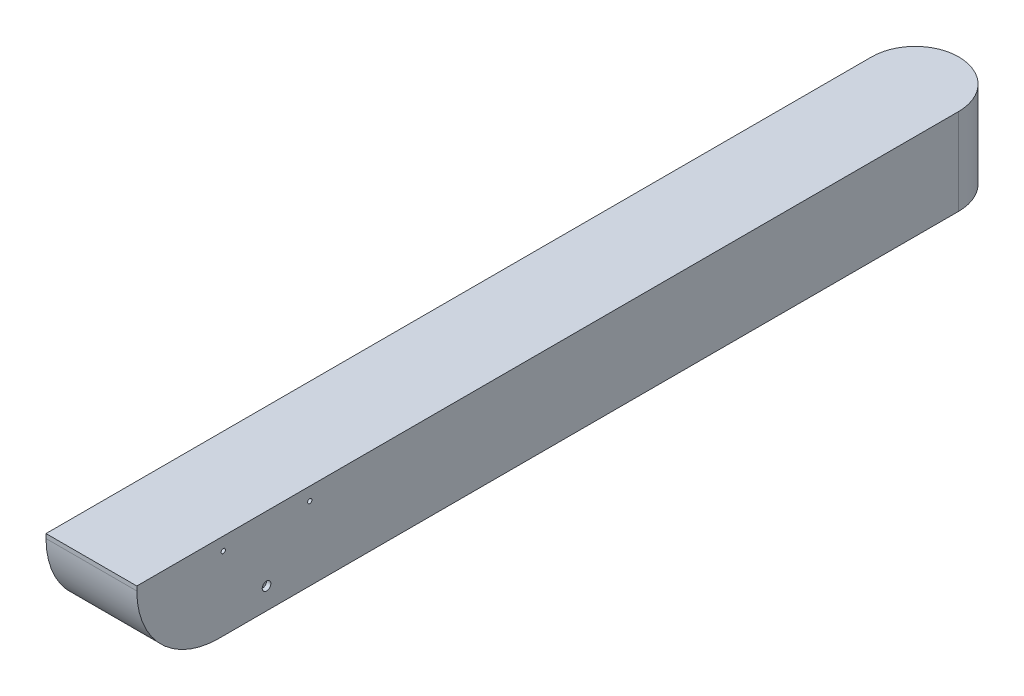
ISO-10303-21;
HEADER;
FILE_DESCRIPTION(('STEP AP214'),'2;1');
FILE_NAME('part.step','',(''),(''),'','','');
FILE_SCHEMA(('AUTOMOTIVE_DESIGN { 1 0 10303 214 1 1 1 1 }'));
ENDSEC;
DATA;
#1=APPLICATION_CONTEXT('core data for automotive mechanical design processes');
#2=APPLICATION_PROTOCOL_DEFINITION('international standard','automotive_design',2000,#1);
#3=PRODUCT_CONTEXT('',#1,'mechanical');
#4=PRODUCT('Part','Part','',(#3));
#5=PRODUCT_RELATED_PRODUCT_CATEGORY('part','',(#4));
#6=PRODUCT_DEFINITION_FORMATION('','',#4);
#7=PRODUCT_DEFINITION_CONTEXT('part definition',#1,'design');
#8=PRODUCT_DEFINITION('design','',#6,#7);
#9=PRODUCT_DEFINITION_SHAPE('','',#8);
#10=(LENGTH_UNIT() NAMED_UNIT(*) SI_UNIT(.MILLI.,.METRE.));
#11=(NAMED_UNIT(*) PLANE_ANGLE_UNIT() SI_UNIT($,.RADIAN.));
#12=(NAMED_UNIT(*) SI_UNIT($,.STERADIAN.) SOLID_ANGLE_UNIT());
#13=UNCERTAINTY_MEASURE_WITH_UNIT(LENGTH_MEASURE(1.E-05),#10,'distance_accuracy_value','');
#14=(GEOMETRIC_REPRESENTATION_CONTEXT(3) GLOBAL_UNCERTAINTY_ASSIGNED_CONTEXT((#13)) GLOBAL_UNIT_ASSIGNED_CONTEXT((#10,
#11,#12)) REPRESENTATION_CONTEXT('',''));
#15=CARTESIAN_POINT('',(0.,0.,0.));
#16=DIRECTION('',(0.,0.,1.));
#17=DIRECTION('',(1.,0.,0.));
#18=AXIS2_PLACEMENT_3D('',#15,#16,#17);
#19=CARTESIAN_POINT('',(100.,200.,100.));
#20=DIRECTION('',(0.,-1.,0.));
#21=DIRECTION('',(0.,0.,-1.));
#22=AXIS2_PLACEMENT_3D('',#19,#20,#21);
#23=CYLINDRICAL_SURFACE('',#22,100.);
#24=DIRECTION('',(0.,-1.,0.));
#25=VECTOR('',#24,1.);
#26=CARTESIAN_POINT('',(0.,200.,100.));
#27=LINE('',#26,#25);
#28=CARTESIAN_POINT('',(0.,200.,100.));
#29=VERTEX_POINT('',#28);
#30=CARTESIAN_POINT('',(0.,0.,100.));
#31=VERTEX_POINT('',#30);
#32=EDGE_CURVE('E127',#29,#31,#27,.T.);
#33=ORIENTED_EDGE('',*,*,#32,.F.);
#34=CARTESIAN_POINT('',(100.,200.,100.));
#35=DIRECTION('',(0.,1.,0.));
#36=DIRECTION('',(0.,0.,1.));
#37=AXIS2_PLACEMENT_3D('',#34,#35,#36);
#38=CIRCLE('',#37,100.);
#39=CARTESIAN_POINT('',(100.,200.,0.));
#40=VERTEX_POINT('',#39);
#41=EDGE_CURVE('E130',#40,#29,#38,.T.);
#42=ORIENTED_EDGE('',*,*,#41,.F.);
#43=DIRECTION('',(0.,1.,0.));
#44=VECTOR('',#43,1.);
#45=CARTESIAN_POINT('',(100.,200.,0.));
#46=LINE('',#45,#44);
#47=CARTESIAN_POINT('',(100.,0.,0.));
#48=VERTEX_POINT('',#47);
#49=EDGE_CURVE('E115',#40,#48,#46,.F.);
#50=ORIENTED_EDGE('',*,*,#49,.T.);
#51=CARTESIAN_POINT('',(100.,0.,100.));
#52=DIRECTION('',(0.,1.,0.));
#53=DIRECTION('',(0.,0.,1.));
#54=AXIS2_PLACEMENT_3D('',#51,#52,#53);
#55=CIRCLE('',#54,100.);
#56=EDGE_CURVE('E132',#31,#48,#55,.F.);
#57=ORIENTED_EDGE('',*,*,#56,.F.);
#58=EDGE_LOOP('',(#33,#42,#50,#57));
#59=FACE_BOUND('',#58,.T.);
#60=ADVANCED_FACE('F38',(#59),#23,.T.);
#61=CARTESIAN_POINT('',(100.,200.,110.));
#62=DIRECTION('',(0.,1.,0.));
#63=DIRECTION('',(0.,0.,1.));
#64=AXIS2_PLACEMENT_3D('',#61,#62,#63);
#65=CYLINDRICAL_SURFACE('',#64,110.);
#66=DIRECTION('',(0.,1.,0.));
#67=VECTOR('',#66,1.);
#68=CARTESIAN_POINT('',(210.,200.,110.));
#69=LINE('',#68,#67);
#70=CARTESIAN_POINT('',(210.,0.,110.));
#71=VERTEX_POINT('',#70);
#72=CARTESIAN_POINT('',(210.,200.,110.));
#73=VERTEX_POINT('',#72);
#74=EDGE_CURVE('E95',#71,#73,#69,.T.);
#75=ORIENTED_EDGE('',*,*,#74,.F.);
#76=CARTESIAN_POINT('',(100.,0.,110.));
#77=DIRECTION('',(0.,1.,0.));
#78=DIRECTION('',(0.,0.,1.));
#79=AXIS2_PLACEMENT_3D('',#76,#77,#78);
#80=CIRCLE('',#79,110.);
#81=EDGE_CURVE('E122',#48,#71,#80,.F.);
#82=ORIENTED_EDGE('',*,*,#81,.F.);
#83=ORIENTED_EDGE('',*,*,#49,.F.);
#84=CARTESIAN_POINT('',(100.,200.,110.));
#85=DIRECTION('',(0.,1.,0.));
#86=DIRECTION('',(0.,0.,1.));
#87=AXIS2_PLACEMENT_3D('',#84,#85,#86);
#88=CIRCLE('',#87,110.);
#89=EDGE_CURVE('E125',#73,#40,#88,.T.);
#90=ORIENTED_EDGE('',*,*,#89,.F.);
#91=EDGE_LOOP('',(#75,#82,#83,#90));
#92=FACE_BOUND('',#91,.T.);
#93=ADVANCED_FACE('F141',(#92),#65,.T.);
#94=CARTESIAN_POINT('',(0.,200.,2010.));
#95=DIRECTION('',(0.,0.,-1.));
#96=DIRECTION('',(-1.,0.,0.));
#97=AXIS2_PLACEMENT_3D('',#94,#95,#96);
#98=PLANE('',#97);
#99=DIRECTION('',(0.,-1.,0.));
#100=VECTOR('',#99,1.);
#101=CARTESIAN_POINT('',(0.,200.,2010.));
#102=LINE('',#101,#100);
#103=CARTESIAN_POINT('',(0.,200.,2010.));
#104=VERTEX_POINT('',#103);
#105=CARTESIAN_POINT('',(0.,190.,2010.));
#106=VERTEX_POINT('',#105);
#107=EDGE_CURVE('E113',#104,#106,#102,.T.);
#108=ORIENTED_EDGE('',*,*,#107,.T.);
#109=DIRECTION('',(1.,0.,0.));
#110=VECTOR('',#109,1.);
#111=CARTESIAN_POINT('',(0.,190.,2010.));
#112=LINE('',#111,#110);
#113=CARTESIAN_POINT('',(210.,190.,2010.));
#114=VERTEX_POINT('',#113);
#115=EDGE_CURVE('E112',#106,#114,#112,.T.);
#116=ORIENTED_EDGE('',*,*,#115,.T.);
#117=DIRECTION('',(0.,-1.,0.));
#118=VECTOR('',#117,1.);
#119=CARTESIAN_POINT('',(210.,200.,2010.));
#120=LINE('',#119,#118);
#121=CARTESIAN_POINT('',(210.,200.,2010.));
#122=VERTEX_POINT('',#121);
#123=EDGE_CURVE('E93',#122,#114,#120,.T.);
#124=ORIENTED_EDGE('',*,*,#123,.F.);
#125=DIRECTION('',(1.,0.,0.));
#126=VECTOR('',#125,1.);
#127=CARTESIAN_POINT('',(0.,200.,2010.));
#128=LINE('',#127,#126);
#129=EDGE_CURVE('E99',#104,#122,#128,.T.);
#130=ORIENTED_EDGE('',*,*,#129,.F.);
#131=EDGE_LOOP('',(#108,#116,#124,#130));
#132=FACE_BOUND('',#131,.T.);
#133=ADVANCED_FACE('F110',(#132),#98,.F.);
#134=CARTESIAN_POINT('',(210.,200.,2010.));
#135=DIRECTION('',(-1.,0.,0.));
#136=DIRECTION('',(0.,0.,1.));
#137=AXIS2_PLACEMENT_3D('',#134,#135,#136);
#138=PLANE('',#137);
#139=CARTESIAN_POINT('',(210.,170.,1610.));
#140=DIRECTION('',(1.,0.,0.));
#141=DIRECTION('',(0.,0.,-1.));
#142=AXIS2_PLACEMENT_3D('',#139,#140,#141);
#143=CIRCLE('',#142,4.99999999999982);
#144=CARTESIAN_POINT('',(210.,170.,1605.));
#145=VERTEX_POINT('',#144);
#146=EDGE_CURVE('E194',#145,#145,#143,.T.);
#147=ORIENTED_EDGE('',*,*,#146,.F.);
#148=EDGE_LOOP('',(#147));
#149=FACE_BOUND('',#148,.T.);
#150=CARTESIAN_POINT('',(210.,170.,1810.));
#151=DIRECTION('',(1.,0.,0.));
#152=DIRECTION('',(0.,0.,-1.));
#153=AXIS2_PLACEMENT_3D('',#150,#151,#152);
#154=CIRCLE('',#153,4.99999999999982);
#155=CARTESIAN_POINT('',(210.,170.,1805.));
#156=VERTEX_POINT('',#155);
#157=EDGE_CURVE('E195',#156,#156,#154,.T.);
#158=ORIENTED_EDGE('',*,*,#157,.F.);
#159=EDGE_LOOP('',(#158));
#160=FACE_BOUND('',#159,.T.);
#161=CARTESIAN_POINT('',(210.,50.,1710.));
#162=DIRECTION('',(1.,0.,0.));
#163=DIRECTION('',(0.,0.,-1.));
#164=AXIS2_PLACEMENT_3D('',#161,#162,#163);
#165=CIRCLE('',#164,10.0000000000001);
#166=CARTESIAN_POINT('',(210.,50.,1700.));
#167=VERTEX_POINT('',#166);
#168=EDGE_CURVE('E197',#167,#167,#165,.T.);
#169=ORIENTED_EDGE('',*,*,#168,.F.);
#170=EDGE_LOOP('',(#169));
#171=FACE_BOUND('',#170,.T.);
#172=ORIENTED_EDGE('',*,*,#123,.T.);
#173=CARTESIAN_POINT('',(210.,190.,1820.));
#174=DIRECTION('',(-1.,0.,0.));
#175=DIRECTION('',(0.,0.,1.));
#176=AXIS2_PLACEMENT_3D('',#173,#174,#175);
#177=CIRCLE('',#176,190.);
#178=CARTESIAN_POINT('',(210.,0.,1820.));
#179=VERTEX_POINT('',#178);
#180=EDGE_CURVE('E60',#114,#179,#177,.F.);
#181=ORIENTED_EDGE('',*,*,#180,.T.);
#182=DIRECTION('',(0.,0.,-1.));
#183=VECTOR('',#182,1.);
#184=CARTESIAN_POINT('',(210.,0.,2010.));
#185=LINE('',#184,#183);
#186=EDGE_CURVE('E146',#179,#71,#185,.T.);
#187=ORIENTED_EDGE('',*,*,#186,.T.);
#188=ORIENTED_EDGE('',*,*,#74,.T.);
#189=DIRECTION('',(0.,0.,-1.));
#190=VECTOR('',#189,1.);
#191=CARTESIAN_POINT('',(210.,200.,2010.));
#192=LINE('',#191,#190);
#193=EDGE_CURVE('E89',#122,#73,#192,.T.);
#194=ORIENTED_EDGE('',*,*,#193,.F.);
#195=EDGE_LOOP('',(#172,#181,#187,#188,#194));
#196=FACE_BOUND('',#195,.T.);
#197=ADVANCED_FACE('F91',(#149,#160,#171,#196),#138,.F.);
#198=CARTESIAN_POINT('',(0.,200.,0.));
#199=DIRECTION('',(1.,0.,0.));
#200=DIRECTION('',(0.,0.,-1.));
#201=AXIS2_PLACEMENT_3D('',#198,#199,#200);
#202=PLANE('',#201);
#203=CARTESIAN_POINT('',(0.,170.,1610.));
#204=DIRECTION('',(1.,0.,0.));
#205=DIRECTION('',(0.,0.,-1.));
#206=AXIS2_PLACEMENT_3D('',#203,#204,#205);
#207=CIRCLE('',#206,4.99999999999982);
#208=CARTESIAN_POINT('',(0.,170.,1605.));
#209=VERTEX_POINT('',#208);
#210=EDGE_CURVE('E191',#209,#209,#207,.T.);
#211=ORIENTED_EDGE('',*,*,#210,.T.);
#212=EDGE_LOOP('',(#211));
#213=FACE_BOUND('',#212,.T.);
#214=CARTESIAN_POINT('',(0.,170.,1810.));
#215=DIRECTION('',(1.,0.,0.));
#216=DIRECTION('',(0.,0.,-1.));
#217=AXIS2_PLACEMENT_3D('',#214,#215,#216);
#218=CIRCLE('',#217,4.99999999999982);
#219=CARTESIAN_POINT('',(0.,170.,1805.));
#220=VERTEX_POINT('',#219);
#221=EDGE_CURVE('E200',#220,#220,#218,.T.);
#222=ORIENTED_EDGE('',*,*,#221,.T.);
#223=EDGE_LOOP('',(#222));
#224=FACE_BOUND('',#223,.T.);
#225=DIRECTION('',(0.,0.,1.));
#226=VECTOR('',#225,1.);
#227=CARTESIAN_POINT('',(0.,0.,0.));
#228=LINE('',#227,#226);
#229=CARTESIAN_POINT('',(0.,0.,1820.));
#230=VERTEX_POINT('',#229);
#231=EDGE_CURVE('E107',#31,#230,#228,.T.);
#232=ORIENTED_EDGE('',*,*,#231,.T.);
#233=CARTESIAN_POINT('',(0.,190.,1820.));
#234=DIRECTION('',(1.,0.,0.));
#235=DIRECTION('',(0.,0.,-1.));
#236=AXIS2_PLACEMENT_3D('',#233,#234,#235);
#237=CIRCLE('',#236,190.);
#238=EDGE_CURVE('E11',#230,#106,#237,.F.);
#239=ORIENTED_EDGE('',*,*,#238,.T.);
#240=ORIENTED_EDGE('',*,*,#107,.F.);
#241=DIRECTION('',(0.,0.,1.));
#242=VECTOR('',#241,1.);
#243=CARTESIAN_POINT('',(0.,200.,0.));
#244=LINE('',#243,#242);
#245=EDGE_CURVE('E98',#29,#104,#244,.T.);
#246=ORIENTED_EDGE('',*,*,#245,.F.);
#247=ORIENTED_EDGE('',*,*,#32,.T.);
#248=EDGE_LOOP('',(#232,#239,#240,#246,#247));
#249=FACE_BOUND('',#248,.T.);
#250=ADVANCED_FACE('F143',(#213,#224,#249),#202,.F.);
#251=CARTESIAN_POINT('',(0.,200.,0.));
#252=DIRECTION('',(0.,1.,0.));
#253=DIRECTION('',(0.,0.,1.));
#254=AXIS2_PLACEMENT_3D('',#251,#252,#253);
#255=PLANE('',#254);
#256=ORIENTED_EDGE('',*,*,#89,.T.);
#257=ORIENTED_EDGE('',*,*,#41,.T.);
#258=ORIENTED_EDGE('',*,*,#245,.T.);
#259=ORIENTED_EDGE('',*,*,#129,.T.);
#260=ORIENTED_EDGE('',*,*,#193,.T.);
#261=EDGE_LOOP('',(#256,#257,#258,#259,#260));
#262=FACE_BOUND('',#261,.T.);
#263=ADVANCED_FACE('F102',(#262),#255,.T.);
#264=CARTESIAN_POINT('',(0.,0.,0.));
#265=DIRECTION('',(0.,1.,0.));
#266=DIRECTION('',(0.,0.,1.));
#267=AXIS2_PLACEMENT_3D('',#264,#265,#266);
#268=PLANE('',#267);
#269=ORIENTED_EDGE('',*,*,#186,.F.);
#270=DIRECTION('',(1.,0.,0.));
#271=VECTOR('',#270,1.);
#272=CARTESIAN_POINT('',(0.,0.,1820.));
#273=LINE('',#272,#271);
#274=EDGE_CURVE('E46',#179,#230,#273,.F.);
#275=ORIENTED_EDGE('',*,*,#274,.T.);
#276=ORIENTED_EDGE('',*,*,#231,.F.);
#277=ORIENTED_EDGE('',*,*,#56,.T.);
#278=ORIENTED_EDGE('',*,*,#81,.T.);
#279=EDGE_LOOP('',(#269,#275,#276,#277,#278));
#280=FACE_BOUND('',#279,.T.);
#281=ADVANCED_FACE('F136',(#280),#268,.F.);
#282=CARTESIAN_POINT('',(0.,190.,1820.));
#283=DIRECTION('',(1.,0.,0.));
#284=DIRECTION('',(0.,0.,-1.));
#285=AXIS2_PLACEMENT_3D('',#282,#283,#284);
#286=CYLINDRICAL_SURFACE('',#285,190.);
#287=ORIENTED_EDGE('',*,*,#238,.F.);
#288=ORIENTED_EDGE('',*,*,#274,.F.);
#289=ORIENTED_EDGE('',*,*,#180,.F.);
#290=ORIENTED_EDGE('',*,*,#115,.F.);
#291=EDGE_LOOP('',(#287,#288,#289,#290));
#292=FACE_BOUND('',#291,.T.);
#293=ADVANCED_FACE('F40',(#292),#286,.T.);
#294=CARTESIAN_POINT('',(200.,50.,1710.));
#295=DIRECTION('',(1.,0.,0.));
#296=DIRECTION('',(0.,0.,-1.));
#297=AXIS2_PLACEMENT_3D('',#294,#295,#296);
#298=CYLINDRICAL_SURFACE('',#297,10.0000000000001);
#299=CARTESIAN_POINT('',(200.,50.,1710.));
#300=DIRECTION('',(1.,0.,0.));
#301=DIRECTION('',(0.,0.,-1.));
#302=AXIS2_PLACEMENT_3D('',#299,#300,#301);
#303=CIRCLE('',#302,10.0000000000001);
#304=CARTESIAN_POINT('',(200.,50.,1700.));
#305=VERTEX_POINT('',#304);
#306=EDGE_CURVE('E147',#305,#305,#303,.T.);
#307=ORIENTED_EDGE('',*,*,#306,.F.);
#308=EDGE_LOOP('',(#307));
#309=FACE_BOUND('',#308,.T.);
#310=ORIENTED_EDGE('',*,*,#168,.T.);
#311=EDGE_LOOP('',(#310));
#312=FACE_BOUND('',#311,.T.);
#313=ADVANCED_FACE('F151',(#309,#312),#298,.F.);
#314=CARTESIAN_POINT('',(200.,50.,1710.));
#315=DIRECTION('',(1.,0.,0.));
#316=DIRECTION('',(0.,0.,-1.));
#317=AXIS2_PLACEMENT_3D('',#314,#315,#316);
#318=PLANE('',#317);
#319=ORIENTED_EDGE('',*,*,#306,.T.);
#320=EDGE_LOOP('',(#319));
#321=FACE_BOUND('',#320,.T.);
#322=ADVANCED_FACE('F156',(#321),#318,.T.);
#323=CARTESIAN_POINT('',(0.,170.,1810.));
#324=DIRECTION('',(1.,0.,0.));
#325=DIRECTION('',(0.,0.,-1.));
#326=AXIS2_PLACEMENT_3D('',#323,#324,#325);
#327=CYLINDRICAL_SURFACE('',#326,4.99999999999982);
#328=ORIENTED_EDGE('',*,*,#221,.F.);
#329=EDGE_LOOP('',(#328));
#330=FACE_BOUND('',#329,.T.);
#331=ORIENTED_EDGE('',*,*,#157,.T.);
#332=EDGE_LOOP('',(#331));
#333=FACE_BOUND('',#332,.T.);
#334=ADVANCED_FACE('F178',(#330,#333),#327,.F.);
#335=CARTESIAN_POINT('',(0.,170.,1610.));
#336=DIRECTION('',(1.,0.,0.));
#337=DIRECTION('',(0.,0.,-1.));
#338=AXIS2_PLACEMENT_3D('',#335,#336,#337);
#339=CYLINDRICAL_SURFACE('',#338,4.99999999999982);
#340=ORIENTED_EDGE('',*,*,#210,.F.);
#341=EDGE_LOOP('',(#340));
#342=FACE_BOUND('',#341,.T.);
#343=ORIENTED_EDGE('',*,*,#146,.T.);
#344=EDGE_LOOP('',(#343));
#345=FACE_BOUND('',#344,.T.);
#346=ADVANCED_FACE('F182',(#342,#345),#339,.F.);
#347=CLOSED_SHELL('',(#60,#93,#133,#197,#250,#263,#281,#293,#313,#322,#334,#346));
#348=MANIFOLD_SOLID_BREP('B2',#347);
#349=ADVANCED_BREP_SHAPE_REPRESENTATION('',(#18,#348),#14);
#350=SHAPE_DEFINITION_REPRESENTATION(#9,#349);
ENDSEC;
END-ISO-10303-21;
